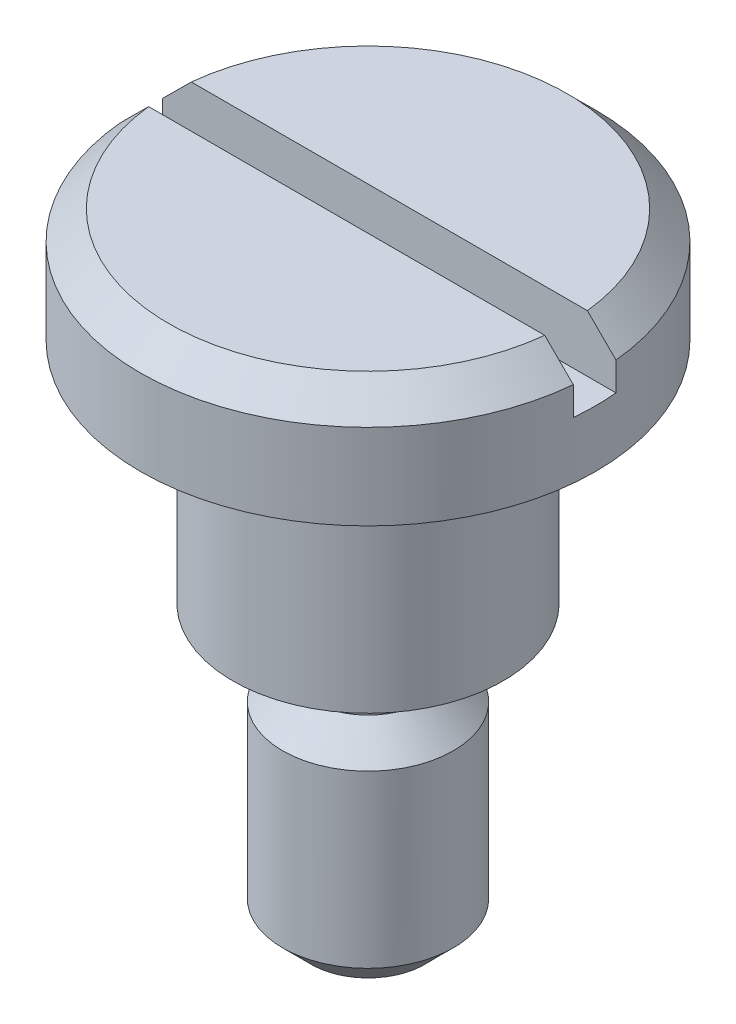
ISO-10303-21;
HEADER;
FILE_DESCRIPTION(('STEP AP214'),'2;1');
FILE_NAME('part.step','',(''),(''),'','','');
FILE_SCHEMA(('AUTOMOTIVE_DESIGN { 1 0 10303 214 1 1 1 1 }'));
ENDSEC;
DATA;
#1=APPLICATION_CONTEXT('core data for automotive mechanical design processes');
#2=APPLICATION_PROTOCOL_DEFINITION('international standard','automotive_design',2000,#1);
#3=PRODUCT_CONTEXT('',#1,'mechanical');
#4=PRODUCT('Part','Part','',(#3));
#5=PRODUCT_RELATED_PRODUCT_CATEGORY('part','',(#4));
#6=PRODUCT_DEFINITION_FORMATION('','',#4);
#7=PRODUCT_DEFINITION_CONTEXT('part definition',#1,'design');
#8=PRODUCT_DEFINITION('design','',#6,#7);
#9=PRODUCT_DEFINITION_SHAPE('','',#8);
#10=(LENGTH_UNIT() NAMED_UNIT(*) SI_UNIT(.MILLI.,.METRE.));
#11=(NAMED_UNIT(*) PLANE_ANGLE_UNIT() SI_UNIT($,.RADIAN.));
#12=(NAMED_UNIT(*) SI_UNIT($,.STERADIAN.) SOLID_ANGLE_UNIT());
#13=UNCERTAINTY_MEASURE_WITH_UNIT(LENGTH_MEASURE(1.E-05),#10,'distance_accuracy_value','');
#14=(GEOMETRIC_REPRESENTATION_CONTEXT(3) GLOBAL_UNCERTAINTY_ASSIGNED_CONTEXT((#13)) GLOBAL_UNIT_ASSIGNED_CONTEXT((#10,
#11,#12)) REPRESENTATION_CONTEXT('',''));
#15=CARTESIAN_POINT('',(0.,0.,0.));
#16=DIRECTION('',(0.,0.,1.));
#17=DIRECTION('',(1.,0.,0.));
#18=AXIS2_PLACEMENT_3D('',#15,#16,#17);
#19=CARTESIAN_POINT('',(8.,22.,0.));
#20=DIRECTION('',(0.,-1.,0.));
#21=DIRECTION('',(1.,0.,0.));
#22=AXIS2_PLACEMENT_3D('',#19,#20,#21);
#23=PLANE('',#22);
#24=CARTESIAN_POINT('',(0.,22.,0.));
#25=DIRECTION('',(0.,-1.,0.));
#26=DIRECTION('',(1.,0.,0.));
#27=AXIS2_PLACEMENT_3D('',#24,#25,#26);
#28=CIRCLE('',#27,6.99999999999999);
#29=CARTESIAN_POINT('',(6.95970545353752,22.,-0.75));
#30=VERTEX_POINT('',#29);
#31=CARTESIAN_POINT('',(-6.95970545353752,22.,-0.75));
#32=VERTEX_POINT('',#31);
#33=EDGE_CURVE('E148',#30,#32,#28,.F.);
#34=ORIENTED_EDGE('',*,*,#33,.T.);
#35=DIRECTION('',(-1.,0.,0.));
#36=VECTOR('',#35,1.);
#37=CARTESIAN_POINT('',(-7.964766161037,22.,-0.75));
#38=LINE('',#37,#36);
#39=EDGE_CURVE('E108',#30,#32,#38,.T.);
#40=ORIENTED_EDGE('',*,*,#39,.F.);
#41=EDGE_LOOP('',(#34,#40));
#42=FACE_BOUND('',#41,.T.);
#43=ADVANCED_FACE('F34',(#42),#23,.F.);
#44=CARTESIAN_POINT('',(0.,22.,0.));
#45=DIRECTION('',(0.,-1.,0.));
#46=DIRECTION('',(1.,0.,0.));
#47=AXIS2_PLACEMENT_3D('',#44,#45,#46);
#48=CONICAL_SURFACE('',#47,6.99999999999999,0.785398163397448);
#49=CARTESIAN_POINT('',(17.5414999807444,11.442473933539,-0.75));
#50=CARTESIAN_POINT('',(16.934728151679,12.0486874615124,-0.75));
#51=CARTESIAN_POINT('',(16.3279318310208,12.6548764823828,-0.75));
#52=CARTESIAN_POINT('',(15.1142562360307,13.8671758328752,-0.75));
#53=CARTESIAN_POINT('',(14.5073769614089,14.4732861622067,-0.75));
#54=CARTESIAN_POINT('',(13.2934560776545,15.6854437937346,-0.75));
#55=CARTESIAN_POINT('',(12.6864144592914,16.2914910866876,-0.75));
#56=CARTESIAN_POINT('',(11.4721610260657,17.5034109072837,-0.75));
#57=CARTESIAN_POINT('',(10.8649492118056,18.1092834355306,-0.75));
#58=CARTESIAN_POINT('',(9.65119667440743,19.3198088995363,-0.75));
#59=CARTESIAN_POINT('',(9.04465637967325,19.9244622647251,-0.75));
#60=CARTESIAN_POINT('',(8.13446986233434,20.831071345008,-0.75));
#61=CARTESIAN_POINT('',(7.8310100371904,21.1332141748789,-0.75));
#62=CARTESIAN_POINT('',(7.22391300253388,21.7373209392757,-0.75));
#63=CARTESIAN_POINT('',(6.92027579321095,22.0392848739921,-0.75));
#64=CARTESIAN_POINT('',(6.3127585031793,22.6429376578914,-0.75));
#65=CARTESIAN_POINT('',(6.00887843554386,22.9446265202264,-0.75));
#66=CARTESIAN_POINT('',(5.40071561745348,23.5476006086176,-0.75));
#67=CARTESIAN_POINT('',(5.0964328653555,23.8488858330169,-0.75));
#68=CARTESIAN_POINT('',(4.48721680699414,24.4507873145134,-0.75));
#69=CARTESIAN_POINT('',(4.18228351313857,24.7514035841502,-0.75));
#70=CARTESIAN_POINT('',(3.72395411736517,25.2013795844683,-0.75));
#71=CARTESIAN_POINT('',(3.57102325198564,25.3512130215695,-0.75));
#72=CARTESIAN_POINT('',(3.26470738597545,25.6504147852155,-0.75));
#73=CARTESIAN_POINT('',(3.11132238644352,25.7997831128838,-0.75));
#74=CARTESIAN_POINT('',(2.87344112197551,26.0303633901401,-0.75));
#75=CARTESIAN_POINT('',(2.78918674736265,26.1118248082896,-0.75));
#76=CARTESIAN_POINT('',(2.62040758518398,26.2744677855789,-0.75));
#77=CARTESIAN_POINT('',(2.5358827965887,26.3556493436509,-0.75));
#78=CARTESIAN_POINT('',(2.36644400534044,26.5176745333187,-0.75));
#79=CARTESIAN_POINT('',(2.28152985917242,26.5985180150561,-0.75));
#80=CARTESIAN_POINT('',(2.11121670939018,26.7596911220156,-0.75));
#81=CARTESIAN_POINT('',(2.02581770947636,26.8400207511495,-0.75));
#82=CARTESIAN_POINT('',(1.82527076370351,27.0270923741968,-0.75));
#83=CARTESIAN_POINT('',(1.70985722780418,27.133551452882,-0.75));
#84=CARTESIAN_POINT('',(1.53525461072992,27.2915201207219,-0.75));
#85=CARTESIAN_POINT('',(1.47682848435559,27.3438707141749,-0.75));
#86=CARTESIAN_POINT('',(1.35928034463947,27.4477787299597,-0.75));
#87=CARTESIAN_POINT('',(1.30015835814014,27.4993361827106,-0.75));
#88=CARTESIAN_POINT('',(1.15799131163723,27.621022220434,-0.75));
#89=CARTESIAN_POINT('',(1.07450917769939,27.690648854116,-0.75));
#90=CARTESIAN_POINT('',(0.946894886136243,27.7923316941437,-0.75));
#91=CARTESIAN_POINT('',(0.90389897747285,27.8258095104373,-0.75));
#92=CARTESIAN_POINT('',(0.816885694502634,27.8914071251364,-0.75));
#93=CARTESIAN_POINT('',(0.772868497697674,27.9235271568293,-0.75));
#94=CARTESIAN_POINT('',(0.69298265722103,27.9791718137957,-0.75));
#95=CARTESIAN_POINT('',(0.657375651358466,28.0030698805079,-0.75));
#96=CARTESIAN_POINT('',(0.585063694272161,28.0491992537746,-0.75));
#97=CARTESIAN_POINT('',(0.54835823871039,28.0714297777506,-0.75));
#98=CARTESIAN_POINT('',(0.473720096188376,28.1134547675553,-0.75));
#99=CARTESIAN_POINT('',(0.435791979005953,28.133257217005,-0.75));
#100=CARTESIAN_POINT('',(0.358375955998075,28.1694794840139,-0.75));
#101=CARTESIAN_POINT('',(0.318889927131753,28.1859032323201,-0.75));
#102=CARTESIAN_POINT('',(0.233864997275503,28.2154964657084,-0.75));
#103=CARTESIAN_POINT('',(0.188130389790628,28.2281300615747,-0.75));
#104=CARTESIAN_POINT('',(0.0952562653113347,28.2453353611092,-0.75));
#105=CARTESIAN_POINT('',(0.0481228412745358,28.2499379436972,-0.75));
#106=CARTESIAN_POINT('',(-0.0463420306781687,28.2500610091859,-0.75));
#107=CARTESIAN_POINT('',(-0.0936735338268064,28.245545993239,-0.75));
#108=CARTESIAN_POINT('',(-0.1869160048223,28.2284362039912,-0.75));
#109=CARTESIAN_POINT('',(-0.232821637633046,28.2158142055641,-0.75));
#110=CARTESIAN_POINT('',(-0.326356777383556,28.183352972457,-0.75));
#111=CARTESIAN_POINT('',(-0.373795005324541,28.1629863962203,-0.75));
#112=CARTESIAN_POINT('',(-0.466480009797677,28.1176933624451,-0.75));
#113=CARTESIAN_POINT('',(-0.511722235371966,28.0927579074271,-0.75));
#114=CARTESIAN_POINT('',(-0.600770314434956,28.0397197682557,-0.75));
#115=CARTESIAN_POINT('',(-0.644561752123602,28.01159330458,-0.75));
#116=CARTESIAN_POINT('',(-0.730728584600748,27.9533579234847,-0.75));
#117=CARTESIAN_POINT('',(-0.773105280842991,27.923250908266,-0.75));
#118=CARTESIAN_POINT('',(-0.86096669260368,27.8586004765428,-0.75));
#119=CARTESIAN_POINT('',(-0.906344484700812,27.8239127286333,-0.75));
#120=CARTESIAN_POINT('',(-0.996179963196404,27.7533616832507,-0.75));
#121=CARTESIAN_POINT('',(-1.04063753157695,27.7174982365005,-0.75));
#122=CARTESIAN_POINT('',(-1.17301852220231,27.6086255494271,-0.75));
#123=CARTESIAN_POINT('',(-1.25990957775717,27.5343648950202,-0.75));
#124=CARTESIAN_POINT('',(-1.4321891766369,27.3838505880067,-0.75));
#125=CARTESIAN_POINT('',(-1.51757490297322,27.307593750691,-0.75));
#126=CARTESIAN_POINT('',(-1.68725017110537,27.1539173411141,-0.75));
#127=CARTESIAN_POINT('',(-1.77154000102012,27.0764980864864,-0.75));
#128=CARTESIAN_POINT('',(-1.93908533695118,26.9211600557452,-0.75));
#129=CARTESIAN_POINT('',(-2.02234349311558,26.8432441287644,-0.75));
#130=CARTESIAN_POINT('',(-2.18835145736876,26.686861916576,-0.75));
#131=CARTESIAN_POINT('',(-2.27110123054646,26.6083955943474,-0.75));
#132=CARTESIAN_POINT('',(-2.4361405686901,26.4511463950929,-0.75));
#133=CARTESIAN_POINT('',(-2.51843051238192,26.3723639151284,-0.75));
#134=CARTESIAN_POINT('',(-2.68272315787683,26.214503950753,-0.75));
#135=CARTESIAN_POINT('',(-2.76472586619165,26.1354264731149,-0.75));
#136=CARTESIAN_POINT('',(-3.0097772209482,25.8984658074307,-0.75));
#137=CARTESIAN_POINT('',(-3.17250263509659,25.7402484571436,-0.75));
#138=CARTESIAN_POINT('',(-3.49740744762277,25.4232538641055,-0.75));
#139=CARTESIAN_POINT('',(-3.65958684409572,25.2644766194052,-0.75));
#140=CARTESIAN_POINT('',(-4.14558747494633,24.7875862935706,-0.75));
#141=CARTESIAN_POINT('',(-4.4688656337781,24.468919985165,-0.75));
#142=CARTESIAN_POINT('',(-5.11481744847824,23.8307201509279,-0.75));
#143=CARTESIAN_POINT('',(-5.43749081303524,23.5111863307703,-0.75));
#144=CARTESIAN_POINT('',(-6.08239683995079,22.8716792748441,-0.75));
#145=CARTESIAN_POINT('',(-6.40462950571259,22.5517060425075,-0.75));
#146=CARTESIAN_POINT('',(-7.04895014607161,21.9113517083915,-0.75));
#147=CARTESIAN_POINT('',(-7.37103800826907,21.5909704935644,-0.75));
#148=CARTESIAN_POINT('',(-8.01502708700054,20.9500192174201,-0.75));
#149=CARTESIAN_POINT('',(-8.33692830314787,20.6294491557145,-0.75));
#150=CARTESIAN_POINT('',(-9.30236300677184,19.667619271465,-0.75));
#151=CARTESIAN_POINT('',(-9.94570272604828,19.0261649744975,-0.75));
#152=CARTESIAN_POINT('',(-11.1687078817978,17.8062110617129,-0.75));
#153=CARTESIAN_POINT('',(-11.7483995935195,17.227737779525,-0.75));
#154=CARTESIAN_POINT('',(-12.907656209652,16.0706208222213,-0.75));
#155=CARTESIAN_POINT('',(-13.4872211085098,15.4919771415426,-0.75));
#156=CARTESIAN_POINT('',(-14.6459557776393,14.3348859776017,-0.75));
#157=CARTESIAN_POINT('',(-15.2251255985507,13.7564385450473,-0.75));
#158=CARTESIAN_POINT('',(-16.3833711958861,12.5994929807352,-0.75));
#159=CARTESIAN_POINT('',(-16.9624469750232,12.0209948516936,-0.75));
#160=CARTESIAN_POINT('',(-17.5414999807444,11.442473933539,-0.75));
#161=B_SPLINE_CURVE_WITH_KNOTS('',3,(#49,#50,#51,#52,#53,#54,#55,#56,#57,#58,#59,#60,#61,#62,
#63,#64,#65,#66,#67,#68,#69,#70,#71,#72,#73,#74,#75,#76,#77,#78,#79,#80,#81,#82,#83,#84,#85,#86,
#87,#88,#89,#90,#91,#92,#93,#94,#95,#96,#97,#98,#99,#100,#101,#102,#103,#104,#105,#106,#107,
#108,#109,#110,#111,#112,#113,#114,#115,#116,#117,#118,#119,#120,#121,#122,#123,#124,#125,#126,
#127,#128,#129,#130,#131,#132,#133,#134,#135,#136,#137,#138,#139,#140,#141,#142,#143,#144,#145,
#146,#147,#148,#149,#150,#151,#152,#153,#154,#155,#156,#157,#158,#159,#160),.UNSPECIFIED.,.F.,
.F.,(4,2,2,2,2,2,2,2,2,2,2,2,2,2,2,2,2,2,2,2,2,2,2,2,2,2,2,2,2,2,2,2,2,2,2,2,2,2,2,2,2,2,2,2,2,
2,2,2,2,2,2,2,2,2,2,4),(0.,2.57313079333366,5.14627082615955,7.71962185103834,10.2929638775751,
12.8622965532835,14.1469767696476,15.4316556150889,16.7162694249575,18.0008884925675,
19.2854832738205,19.9277764015614,20.5700679766135,20.9216536893458,21.273240742164,
21.624969911041,21.9766963991221,22.4477226520162,22.6830624330437,22.9183931655176,
23.2444345257296,23.4078943970678,23.5713260684801,23.6999427338592,23.8286193862769,
23.956860902481,24.0849523693729,24.2267429529487,24.3679871461479,24.5097823257481,
24.6520561939771,24.8065659402137,24.9613832977727,25.1174412949234,25.273351536328,
25.4446757166792,25.6160217347511,25.9588668977179,26.3022971092458,26.6456351264355,
26.9877217466526,27.329831601391,27.6715978731879,28.0133563461948,28.6942433756892,
29.3751327780865,30.7369346679042,32.0992777814274,33.4616103142848,34.8244977613734,
36.1873880219313,38.9128504459925,41.3696907461412,43.8266229233733,46.2823004252134,
48.7378858030531),.UNSPECIFIED.);
#162=CARTESIAN_POINT('',(7.964766161037,21.,-0.75));
#163=VERTEX_POINT('',#162);
#164=EDGE_CURVE('E11',#163,#30,#161,.T.);
#165=ORIENTED_EDGE('',*,*,#164,.F.);
#166=CARTESIAN_POINT('',(0.,21.,0.));
#167=DIRECTION('',(0.,-1.,0.));
#168=DIRECTION('',(1.,0.,0.));
#169=AXIS2_PLACEMENT_3D('',#166,#167,#168);
#170=CIRCLE('',#169,8.);
#171=CARTESIAN_POINT('',(-7.964766161037,21.,-0.75));
#172=VERTEX_POINT('',#171);
#173=EDGE_CURVE('E151',#172,#163,#170,.T.);
#174=ORIENTED_EDGE('',*,*,#173,.F.);
#175=EDGE_CURVE('E39',#32,#172,#161,.T.);
#176=ORIENTED_EDGE('',*,*,#175,.F.);
#177=ORIENTED_EDGE('',*,*,#33,.F.);
#178=EDGE_LOOP('',(#165,#174,#176,#177));
#179=FACE_BOUND('',#178,.T.);
#180=ADVANCED_FACE('F195',(#179),#48,.T.);
#181=CARTESIAN_POINT('',(0.,0.,0.));
#182=DIRECTION('',(0.,1.,0.));
#183=DIRECTION('',(-1.,0.,0.));
#184=AXIS2_PLACEMENT_3D('',#181,#182,#183);
#185=PLANE('',#184);
#186=CARTESIAN_POINT('',(0.,0.,0.));
#187=DIRECTION('',(0.,1.,0.));
#188=DIRECTION('',(-1.,0.,0.));
#189=AXIS2_PLACEMENT_3D('',#186,#187,#188);
#190=CIRCLE('',#189,1.99999999999999);
#191=CARTESIAN_POINT('',(-1.99999999999999,0.,0.));
#192=VERTEX_POINT('',#191);
#193=EDGE_CURVE('E144',#192,#192,#190,.F.);
#194=ORIENTED_EDGE('',*,*,#193,.T.);
#195=EDGE_LOOP('',(#194));
#196=FACE_BOUND('',#195,.T.);
#197=ADVANCED_FACE('F191',(#196),#185,.F.);
#198=CARTESIAN_POINT('',(0.,22.,0.));
#199=DIRECTION('',(0.,1.,0.));
#200=DIRECTION('',(-1.,0.,0.));
#201=AXIS2_PLACEMENT_3D('',#198,#199,#200);
#202=CYLINDRICAL_SURFACE('',#201,3.);
#203=CARTESIAN_POINT('',(0.,6.99999999999999,0.));
#204=DIRECTION('',(0.,-1.,0.));
#205=DIRECTION('',(1.,0.,0.));
#206=AXIS2_PLACEMENT_3D('',#203,#204,#205);
#207=CIRCLE('',#206,3.);
#208=CARTESIAN_POINT('',(3.,6.99999999999999,0.));
#209=VERTEX_POINT('',#208);
#210=EDGE_CURVE('E141',#209,#209,#207,.T.);
#211=ORIENTED_EDGE('',*,*,#210,.T.);
#212=EDGE_LOOP('',(#211));
#213=FACE_BOUND('',#212,.T.);
#214=CARTESIAN_POINT('',(0.,1.,0.));
#215=DIRECTION('',(0.,1.,0.));
#216=DIRECTION('',(-1.,0.,0.));
#217=AXIS2_PLACEMENT_3D('',#214,#215,#216);
#218=CIRCLE('',#217,3.);
#219=CARTESIAN_POINT('',(-3.,1.,0.));
#220=VERTEX_POINT('',#219);
#221=EDGE_CURVE('E138',#220,#220,#218,.T.);
#222=ORIENTED_EDGE('',*,*,#221,.T.);
#223=EDGE_LOOP('',(#222));
#224=FACE_BOUND('',#223,.T.);
#225=ADVANCED_FACE('F187',(#213,#224),#202,.T.);
#226=CARTESIAN_POINT('',(0.,22.,0.));
#227=DIRECTION('',(0.,1.,0.));
#228=DIRECTION('',(-1.,0.,0.));
#229=AXIS2_PLACEMENT_3D('',#226,#227,#228);
#230=CYLINDRICAL_SURFACE('',#229,2.);
#231=CARTESIAN_POINT('',(0.,10.,0.));
#232=DIRECTION('',(0.,1.,0.));
#233=DIRECTION('',(-1.,0.,0.));
#234=AXIS2_PLACEMENT_3D('',#231,#232,#233);
#235=CIRCLE('',#234,2.);
#236=CARTESIAN_POINT('',(-2.,10.,0.));
#237=VERTEX_POINT('',#236);
#238=EDGE_CURVE('E132',#237,#237,#235,.T.);
#239=ORIENTED_EDGE('',*,*,#238,.F.);
#240=EDGE_LOOP('',(#239));
#241=FACE_BOUND('',#240,.T.);
#242=CARTESIAN_POINT('',(0.,8.,0.));
#243=DIRECTION('',(0.,1.,0.));
#244=DIRECTION('',(-1.,0.,0.));
#245=AXIS2_PLACEMENT_3D('',#242,#243,#244);
#246=CIRCLE('',#245,2.);
#247=CARTESIAN_POINT('',(-2.,8.,0.));
#248=VERTEX_POINT('',#247);
#249=EDGE_CURVE('E135',#248,#248,#246,.T.);
#250=ORIENTED_EDGE('',*,*,#249,.T.);
#251=EDGE_LOOP('',(#250));
#252=FACE_BOUND('',#251,.T.);
#253=ADVANCED_FACE('F183',(#241,#252),#230,.T.);
#254=CARTESIAN_POINT('',(2.,10.,0.));
#255=DIRECTION('',(0.,1.,0.));
#256=DIRECTION('',(-1.,0.,0.));
#257=AXIS2_PLACEMENT_3D('',#254,#255,#256);
#258=PLANE('',#257);
#259=CARTESIAN_POINT('',(0.,10.,0.));
#260=DIRECTION('',(0.,1.,0.));
#261=DIRECTION('',(-1.,0.,0.));
#262=AXIS2_PLACEMENT_3D('',#259,#260,#261);
#263=CIRCLE('',#262,4.75);
#264=CARTESIAN_POINT('',(-4.75,10.,0.));
#265=VERTEX_POINT('',#264);
#266=EDGE_CURVE('E129',#265,#265,#263,.T.);
#267=ORIENTED_EDGE('',*,*,#266,.F.);
#268=EDGE_LOOP('',(#267));
#269=FACE_BOUND('',#268,.T.);
#270=ORIENTED_EDGE('',*,*,#238,.T.);
#271=EDGE_LOOP('',(#270));
#272=FACE_BOUND('',#271,.T.);
#273=ADVANCED_FACE('F179',(#269,#272),#258,.F.);
#274=CARTESIAN_POINT('',(0.,22.,0.));
#275=DIRECTION('',(0.,1.,0.));
#276=DIRECTION('',(-1.,0.,0.));
#277=AXIS2_PLACEMENT_3D('',#274,#275,#276);
#278=CYLINDRICAL_SURFACE('',#277,4.75);
#279=CARTESIAN_POINT('',(0.,18.,0.));
#280=DIRECTION('',(0.,1.,0.));
#281=DIRECTION('',(-1.,0.,0.));
#282=AXIS2_PLACEMENT_3D('',#279,#280,#281);
#283=CIRCLE('',#282,4.75);
#284=CARTESIAN_POINT('',(-4.75,18.,0.));
#285=VERTEX_POINT('',#284);
#286=EDGE_CURVE('E125',#285,#285,#283,.T.);
#287=ORIENTED_EDGE('',*,*,#286,.F.);
#288=EDGE_LOOP('',(#287));
#289=FACE_BOUND('',#288,.T.);
#290=ORIENTED_EDGE('',*,*,#266,.T.);
#291=EDGE_LOOP('',(#290));
#292=FACE_BOUND('',#291,.T.);
#293=ADVANCED_FACE('F175',(#289,#292),#278,.T.);
#294=CARTESIAN_POINT('',(4.75,18.,0.));
#295=DIRECTION('',(0.,1.,0.));
#296=DIRECTION('',(-1.,0.,0.));
#297=AXIS2_PLACEMENT_3D('',#294,#295,#296);
#298=PLANE('',#297);
#299=CARTESIAN_POINT('',(0.,18.,0.));
#300=DIRECTION('',(0.,1.,0.));
#301=DIRECTION('',(-1.,0.,0.));
#302=AXIS2_PLACEMENT_3D('',#299,#300,#301);
#303=CIRCLE('',#302,8.);
#304=CARTESIAN_POINT('',(-8.,18.,0.));
#305=VERTEX_POINT('',#304);
#306=EDGE_CURVE('E122',#305,#305,#303,.T.);
#307=ORIENTED_EDGE('',*,*,#306,.F.);
#308=EDGE_LOOP('',(#307));
#309=FACE_BOUND('',#308,.T.);
#310=ORIENTED_EDGE('',*,*,#286,.T.);
#311=EDGE_LOOP('',(#310));
#312=FACE_BOUND('',#311,.T.);
#313=ADVANCED_FACE('F172',(#309,#312),#298,.F.);
#314=CARTESIAN_POINT('',(0.,22.,0.));
#315=DIRECTION('',(0.,1.,0.));
#316=DIRECTION('',(-1.,0.,0.));
#317=AXIS2_PLACEMENT_3D('',#314,#315,#316);
#318=CYLINDRICAL_SURFACE('',#317,8.);
#319=ORIENTED_EDGE('',*,*,#173,.T.);
#320=DIRECTION('',(0.,1.,0.));
#321=VECTOR('',#320,1.);
#322=CARTESIAN_POINT('',(7.964766161037,20.,-0.75));
#323=LINE('',#322,#321);
#324=CARTESIAN_POINT('',(7.964766161037,20.,-0.75));
#325=VERTEX_POINT('',#324);
#326=EDGE_CURVE('E117',#325,#163,#323,.T.);
#327=ORIENTED_EDGE('',*,*,#326,.F.);
#328=CARTESIAN_POINT('',(0.,20.,0.));
#329=DIRECTION('',(0.,1.,0.));
#330=DIRECTION('',(0.,0.,1.));
#331=AXIS2_PLACEMENT_3D('',#328,#329,#330);
#332=CIRCLE('',#331,8.);
#333=CARTESIAN_POINT('',(7.964766161037,20.,0.75));
#334=VERTEX_POINT('',#333);
#335=EDGE_CURVE('E99',#334,#325,#332,.T.);
#336=ORIENTED_EDGE('',*,*,#335,.F.);
#337=DIRECTION('',(0.,1.,0.));
#338=VECTOR('',#337,1.);
#339=CARTESIAN_POINT('',(7.964766161037,20.,0.75));
#340=LINE('',#339,#338);
#341=CARTESIAN_POINT('',(7.964766161037,21.,0.75));
#342=VERTEX_POINT('',#341);
#343=EDGE_CURVE('E96',#334,#342,#340,.T.);
#344=ORIENTED_EDGE('',*,*,#343,.T.);
#345=CARTESIAN_POINT('',(-7.964766161037,21.,0.75));
#346=VERTEX_POINT('',#345);
#347=EDGE_CURVE('E115',#342,#346,#170,.T.);
#348=ORIENTED_EDGE('',*,*,#347,.T.);
#349=DIRECTION('',(0.,1.,0.));
#350=VECTOR('',#349,1.);
#351=CARTESIAN_POINT('',(-7.964766161037,20.,0.75));
#352=LINE('',#351,#350);
#353=CARTESIAN_POINT('',(-7.964766161037,20.,0.75));
#354=VERTEX_POINT('',#353);
#355=EDGE_CURVE('E93',#354,#346,#352,.T.);
#356=ORIENTED_EDGE('',*,*,#355,.F.);
#357=CARTESIAN_POINT('',(0.,20.,0.));
#358=DIRECTION('',(0.,1.,0.));
#359=DIRECTION('',(0.,0.,1.));
#360=AXIS2_PLACEMENT_3D('',#357,#358,#359);
#361=CIRCLE('',#360,8.);
#362=CARTESIAN_POINT('',(-7.964766161037,20.,-0.75));
#363=VERTEX_POINT('',#362);
#364=EDGE_CURVE('E100',#363,#354,#361,.T.);
#365=ORIENTED_EDGE('',*,*,#364,.F.);
#366=DIRECTION('',(0.,1.,0.));
#367=VECTOR('',#366,1.);
#368=CARTESIAN_POINT('',(-7.964766161037,20.,-0.75));
#369=LINE('',#368,#367);
#370=EDGE_CURVE('E126',#363,#172,#369,.T.);
#371=ORIENTED_EDGE('',*,*,#370,.T.);
#372=EDGE_LOOP('',(#319,#327,#336,#344,#348,#356,#365,#371));
#373=FACE_BOUND('',#372,.T.);
#374=ORIENTED_EDGE('',*,*,#306,.T.);
#375=EDGE_LOOP('',(#374));
#376=FACE_BOUND('',#375,.T.);
#377=ADVANCED_FACE('F112',(#373,#376),#318,.T.);
#378=CARTESIAN_POINT('',(-6.95970545353752,22.,0.75));
#379=VERTEX_POINT('',#378);
#380=CARTESIAN_POINT('',(6.95970545353752,22.,0.75));
#381=VERTEX_POINT('',#380);
#382=EDGE_CURVE('E147',#379,#381,#28,.F.);
#383=ORIENTED_EDGE('',*,*,#382,.T.);
#384=DIRECTION('',(1.,0.,0.));
#385=VECTOR('',#384,1.);
#386=CARTESIAN_POINT('',(-7.964766161037,22.,0.75));
#387=LINE('',#386,#385);
#388=EDGE_CURVE('E55',#379,#381,#387,.T.);
#389=ORIENTED_EDGE('',*,*,#388,.F.);
#390=EDGE_LOOP('',(#383,#389));
#391=FACE_BOUND('',#390,.T.);
#392=ADVANCED_FACE('F165',(#391),#23,.F.);
#393=CARTESIAN_POINT('',(0.,8.,0.));
#394=DIRECTION('',(0.,-1.,0.));
#395=DIRECTION('',(1.,0.,0.));
#396=AXIS2_PLACEMENT_3D('',#393,#394,#395);
#397=CONICAL_SURFACE('',#396,1.99999999999999,0.785398163397446);
#398=ORIENTED_EDGE('',*,*,#210,.F.);
#399=EDGE_LOOP('',(#398));
#400=FACE_BOUND('',#399,.T.);
#401=ORIENTED_EDGE('',*,*,#249,.F.);
#402=EDGE_LOOP('',(#401));
#403=FACE_BOUND('',#402,.T.);
#404=ADVANCED_FACE('F168',(#400,#403),#397,.T.);
#405=CARTESIAN_POINT('',(0.,1.,0.));
#406=DIRECTION('',(0.,1.,0.));
#407=DIRECTION('',(-1.,0.,0.));
#408=AXIS2_PLACEMENT_3D('',#405,#406,#407);
#409=CONICAL_SURFACE('',#408,3.,0.78539816339745);
#410=ORIENTED_EDGE('',*,*,#193,.F.);
#411=EDGE_LOOP('',(#410));
#412=FACE_BOUND('',#411,.T.);
#413=ORIENTED_EDGE('',*,*,#221,.F.);
#414=EDGE_LOOP('',(#413));
#415=FACE_BOUND('',#414,.T.);
#416=ADVANCED_FACE('F198',(#412,#415),#409,.T.);
#417=CARTESIAN_POINT('',(-17.5414999807444,11.442473933539,0.75));
#418=CARTESIAN_POINT('',(-16.934728151679,12.0486874615124,0.75));
#419=CARTESIAN_POINT('',(-16.3279318310208,12.6548764823828,0.75));
#420=CARTESIAN_POINT('',(-15.1142562360308,13.8671758328752,0.75));
#421=CARTESIAN_POINT('',(-14.5073769614089,14.4732861622067,0.75));
#422=CARTESIAN_POINT('',(-13.2934560776545,15.6854437937346,0.75));
#423=CARTESIAN_POINT('',(-12.6864144592914,16.2914910866875,0.75));
#424=CARTESIAN_POINT('',(-11.4721610260657,17.5034109072837,0.75));
#425=CARTESIAN_POINT('',(-10.8649492118057,18.1092834355306,0.75));
#426=CARTESIAN_POINT('',(-9.65119667440746,19.3198088995362,0.75));
#427=CARTESIAN_POINT('',(-9.04465637967328,19.9244622647251,0.75));
#428=CARTESIAN_POINT('',(-8.13446986233436,20.831071345008,0.75));
#429=CARTESIAN_POINT('',(-7.83101003719042,21.1332141748789,0.75));
#430=CARTESIAN_POINT('',(-7.2239130025339,21.7373209392757,0.75));
#431=CARTESIAN_POINT('',(-6.92027579321096,22.0392848739921,0.75));
#432=CARTESIAN_POINT('',(-6.31275850317931,22.6429376578914,0.75));
#433=CARTESIAN_POINT('',(-6.00887843554388,22.9446265202264,0.75));
#434=CARTESIAN_POINT('',(-5.40071561745349,23.5476006086176,0.75));
#435=CARTESIAN_POINT('',(-5.09643286535551,23.8488858330169,0.75));
#436=CARTESIAN_POINT('',(-4.48721680699415,24.4507873145134,0.75));
#437=CARTESIAN_POINT('',(-4.18228351313858,24.7514035841502,0.75));
#438=CARTESIAN_POINT('',(-3.72395411736517,25.2013795844683,0.75));
#439=CARTESIAN_POINT('',(-3.57102325198564,25.3512130215695,0.75));
#440=CARTESIAN_POINT('',(-3.26470738597545,25.6504147852155,0.75));
#441=CARTESIAN_POINT('',(-3.11132238644352,25.7997831128838,0.75));
#442=CARTESIAN_POINT('',(-2.87344112197551,26.0303633901401,0.75));
#443=CARTESIAN_POINT('',(-2.78918674736265,26.1118248082896,0.75));
#444=CARTESIAN_POINT('',(-2.62040758518398,26.2744677855789,0.75));
#445=CARTESIAN_POINT('',(-2.5358827965887,26.3556493436509,0.75));
#446=CARTESIAN_POINT('',(-2.36644400534044,26.5176745333187,0.75));
#447=CARTESIAN_POINT('',(-2.28152985917242,26.5985180150561,0.75));
#448=CARTESIAN_POINT('',(-2.11121670939018,26.7596911220156,0.75));
#449=CARTESIAN_POINT('',(-2.02581770947636,26.8400207511495,0.75));
#450=CARTESIAN_POINT('',(-1.82527076370352,27.0270923741968,0.75));
#451=CARTESIAN_POINT('',(-1.70985722780418,27.133551452882,0.75));
#452=CARTESIAN_POINT('',(-1.53525461072993,27.2915201207219,0.75));
#453=CARTESIAN_POINT('',(-1.47682848435559,27.3438707141749,0.75));
#454=CARTESIAN_POINT('',(-1.35928034463947,27.4477787299597,0.75));
#455=CARTESIAN_POINT('',(-1.30015835814014,27.4993361827106,0.75));
#456=CARTESIAN_POINT('',(-1.15799131163723,27.621022220434,0.75));
#457=CARTESIAN_POINT('',(-1.07450917769939,27.690648854116,0.75));
#458=CARTESIAN_POINT('',(-0.946894886136245,27.7923316941437,0.75));
#459=CARTESIAN_POINT('',(-0.903898977472851,27.8258095104373,0.75));
#460=CARTESIAN_POINT('',(-0.816885694502636,27.8914071251364,0.75));
#461=CARTESIAN_POINT('',(-0.772868497697675,27.9235271568293,0.75));
#462=CARTESIAN_POINT('',(-0.692982657221032,27.9791718137957,0.75));
#463=CARTESIAN_POINT('',(-0.65737565135847,28.0030698805079,0.75));
#464=CARTESIAN_POINT('',(-0.585063694272165,28.0491992537746,0.75));
#465=CARTESIAN_POINT('',(-0.548358238710392,28.0714297777506,0.75));
#466=CARTESIAN_POINT('',(-0.473720096188376,28.1134547675553,0.75));
#467=CARTESIAN_POINT('',(-0.435791979005954,28.133257217005,0.75));
#468=CARTESIAN_POINT('',(-0.358375955998077,28.1694794840139,0.75));
#469=CARTESIAN_POINT('',(-0.318889927131753,28.1859032323201,0.75));
#470=CARTESIAN_POINT('',(-0.233864997275502,28.2154964657084,0.75));
#471=CARTESIAN_POINT('',(-0.188130389790627,28.2281300615747,0.75));
#472=CARTESIAN_POINT('',(-0.0952562653113337,28.2453353611092,0.75));
#473=CARTESIAN_POINT('',(-0.0481228412745346,28.2499379436972,0.75));
#474=CARTESIAN_POINT('',(0.0463420306781698,28.2500610091859,0.75));
#475=CARTESIAN_POINT('',(0.0936735338268071,28.245545993239,0.75));
#476=CARTESIAN_POINT('',(0.186916004822301,28.2284362039912,0.75));
#477=CARTESIAN_POINT('',(0.232821637633047,28.2158142055641,0.75));
#478=CARTESIAN_POINT('',(0.326356777383559,28.183352972457,0.75));
#479=CARTESIAN_POINT('',(0.373795005324545,28.1629863962203,0.75));
#480=CARTESIAN_POINT('',(0.466480009797684,28.117693362445,0.75));
#481=CARTESIAN_POINT('',(0.511722235371973,28.0927579074271,0.75));
#482=CARTESIAN_POINT('',(0.600770314434965,28.0397197682557,0.75));
#483=CARTESIAN_POINT('',(0.644561752123612,28.01159330458,0.75));
#484=CARTESIAN_POINT('',(0.730728584600757,27.9533579234847,0.75));
#485=CARTESIAN_POINT('',(0.773105280842999,27.923250908266,0.75));
#486=CARTESIAN_POINT('',(0.860966692603687,27.8586004765428,0.75));
#487=CARTESIAN_POINT('',(0.90634448470082,27.8239127286333,0.75));
#488=CARTESIAN_POINT('',(0.996179963196414,27.7533616832507,0.75));
#489=CARTESIAN_POINT('',(1.04063753157696,27.7174982365005,0.75));
#490=CARTESIAN_POINT('',(1.17301852220233,27.6086255494271,0.75));
#491=CARTESIAN_POINT('',(1.25990957775719,27.5343648950202,0.75));
#492=CARTESIAN_POINT('',(1.43218917663692,27.3838505880066,0.75));
#493=CARTESIAN_POINT('',(1.51757490297324,27.3075937506909,0.75));
#494=CARTESIAN_POINT('',(1.68725017110539,27.1539173411141,0.75));
#495=CARTESIAN_POINT('',(1.77154000102014,27.0764980864864,0.75));
#496=CARTESIAN_POINT('',(1.9390853369512,26.9211600557452,0.75));
#497=CARTESIAN_POINT('',(2.0223434931156,26.8432441287644,0.75));
#498=CARTESIAN_POINT('',(2.18835145736879,26.6868619165759,0.75));
#499=CARTESIAN_POINT('',(2.27110123054649,26.6083955943473,0.75));
#500=CARTESIAN_POINT('',(2.43614056869013,26.4511463950928,0.75));
#501=CARTESIAN_POINT('',(2.51843051238195,26.3723639151283,0.75));
#502=CARTESIAN_POINT('',(2.68272315787686,26.214503950753,0.75));
#503=CARTESIAN_POINT('',(2.76472586619169,26.1354264731149,0.75));
#504=CARTESIAN_POINT('',(3.00977722094824,25.8984658074307,0.75));
#505=CARTESIAN_POINT('',(3.17250263509663,25.7402484571436,0.75));
#506=CARTESIAN_POINT('',(3.49740744762281,25.4232538641054,0.75));
#507=CARTESIAN_POINT('',(3.65958684409576,25.2644766194051,0.75));
#508=CARTESIAN_POINT('',(4.14558747494638,24.7875862935705,0.75));
#509=CARTESIAN_POINT('',(4.46886563377816,24.468919985165,0.75));
#510=CARTESIAN_POINT('',(5.1148174484783,23.8307201509278,0.75));
#511=CARTESIAN_POINT('',(5.43749081303531,23.5111863307703,0.75));
#512=CARTESIAN_POINT('',(6.08239683995087,22.8716792748441,0.75));
#513=CARTESIAN_POINT('',(6.40462950571267,22.5517060425074,0.75));
#514=CARTESIAN_POINT('',(7.04895014607171,21.9113517083914,0.75));
#515=CARTESIAN_POINT('',(7.37103800826917,21.5909704935643,0.75));
#516=CARTESIAN_POINT('',(8.01502708700065,20.95001921742,0.75));
#517=CARTESIAN_POINT('',(8.33692830314799,20.6294491557143,0.75));
#518=CARTESIAN_POINT('',(9.30236300677196,19.6676192714649,0.75));
#519=CARTESIAN_POINT('',(9.94570272604841,19.0261649744974,0.75));
#520=CARTESIAN_POINT('',(11.1687078817979,17.8062110617128,0.75));
#521=CARTESIAN_POINT('',(11.7483995935197,17.2277377795249,0.75));
#522=CARTESIAN_POINT('',(12.9076562096521,16.0706208222212,0.75));
#523=CARTESIAN_POINT('',(13.4872211085099,15.4919771415425,0.75));
#524=CARTESIAN_POINT('',(14.6459557776394,14.3348859776016,0.75));
#525=CARTESIAN_POINT('',(15.2251255985507,13.7564385450473,0.75));
#526=CARTESIAN_POINT('',(16.3833711958862,12.5994929807352,0.75));
#527=CARTESIAN_POINT('',(16.9624469750233,12.0209948516935,0.75));
#528=CARTESIAN_POINT('',(17.5414999807444,11.442473933539,0.75));
#529=B_SPLINE_CURVE_WITH_KNOTS('',3,(#417,#418,#419,#420,#421,#422,#423,#424,#425,#426,#427,
#428,#429,#430,#431,#432,#433,#434,#435,#436,#437,#438,#439,#440,#441,#442,#443,#444,#445,#446,
#447,#448,#449,#450,#451,#452,#453,#454,#455,#456,#457,#458,#459,#460,#461,#462,#463,#464,#465,
#466,#467,#468,#469,#470,#471,#472,#473,#474,#475,#476,#477,#478,#479,#480,#481,#482,#483,#484,
#485,#486,#487,#488,#489,#490,#491,#492,#493,#494,#495,#496,#497,#498,#499,#500,#501,#502,#503,
#504,#505,#506,#507,#508,#509,#510,#511,#512,#513,#514,#515,#516,#517,#518,#519,#520,#521,#522,
#523,#524,#525,#526,#527,#528),.UNSPECIFIED.,.F.,.F.,(4,2,2,2,2,2,2,2,2,2,2,2,2,2,2,2,2,2,2,2,2,
2,2,2,2,2,2,2,2,2,2,2,2,2,2,2,2,2,2,2,2,2,2,2,2,2,2,2,2,2,2,2,2,2,2,4),(0.,2.57313079333365,
5.14627082615953,7.71962185103832,10.2929638775751,12.8622965532835,14.1469767696476,
15.4316556150889,16.7162694249575,18.0008884925675,19.2854832738205,19.9277764015614,
20.5700679766135,20.9216536893458,21.273240742164,21.624969911041,21.9766963991221,
22.4477226520162,22.6830624330437,22.9183931655176,23.2444345257296,23.4078943970678,
23.5713260684801,23.6999427338592,23.8286193862769,23.956860902481,24.0849523693729,
24.2267429529487,24.3679871461479,24.5097823257481,24.6520561939771,24.8065659402137,
24.9613832977727,25.1174412949235,25.273351536328,25.4446757166792,25.6160217347512,
25.9588668977179,26.3022971092458,26.6456351264356,26.9877217466526,27.329831601391,
27.6715978731879,28.0133563461949,28.6942433756893,29.3751327780865,30.7369346679043,
32.0992777814275,33.461610314285,34.8244977613735,36.1873880219315,38.9128504459927,
41.3696907461413,43.8266229233733,46.2823004252134,48.7378858030531),.UNSPECIFIED.);
#530=EDGE_CURVE('E158',#346,#379,#529,.T.);
#531=ORIENTED_EDGE('',*,*,#530,.F.);
#532=ORIENTED_EDGE('',*,*,#347,.F.);
#533=EDGE_CURVE('E152',#381,#342,#529,.T.);
#534=ORIENTED_EDGE('',*,*,#533,.F.);
#535=ORIENTED_EDGE('',*,*,#382,.F.);
#536=EDGE_LOOP('',(#531,#532,#534,#535));
#537=FACE_BOUND('',#536,.T.);
#538=ADVANCED_FACE('F36',(#537),#48,.T.);
#539=CARTESIAN_POINT('',(-7.964766161037,20.,-0.75));
#540=DIRECTION('',(0.,0.,-1.));
#541=DIRECTION('',(-1.,0.,0.));
#542=AXIS2_PLACEMENT_3D('',#539,#540,#541);
#543=PLANE('',#542);
#544=ORIENTED_EDGE('',*,*,#164,.T.);
#545=ORIENTED_EDGE('',*,*,#39,.T.);
#546=ORIENTED_EDGE('',*,*,#175,.T.);
#547=ORIENTED_EDGE('',*,*,#370,.F.);
#548=DIRECTION('',(-1.,0.,0.));
#549=VECTOR('',#548,1.);
#550=CARTESIAN_POINT('',(-7.964766161037,20.,-0.75));
#551=LINE('',#550,#549);
#552=EDGE_CURVE('E106',#325,#363,#551,.T.);
#553=ORIENTED_EDGE('',*,*,#552,.F.);
#554=ORIENTED_EDGE('',*,*,#326,.T.);
#555=EDGE_LOOP('',(#544,#545,#546,#547,#553,#554));
#556=FACE_BOUND('',#555,.T.);
#557=ADVANCED_FACE('F162',(#556),#543,.F.);
#558=CARTESIAN_POINT('',(-7.964766161037,20.,0.75));
#559=DIRECTION('',(0.,0.,1.));
#560=DIRECTION('',(1.,0.,0.));
#561=AXIS2_PLACEMENT_3D('',#558,#559,#560);
#562=PLANE('',#561);
#563=ORIENTED_EDGE('',*,*,#530,.T.);
#564=ORIENTED_EDGE('',*,*,#388,.T.);
#565=ORIENTED_EDGE('',*,*,#533,.T.);
#566=ORIENTED_EDGE('',*,*,#343,.F.);
#567=DIRECTION('',(1.,0.,0.));
#568=VECTOR('',#567,1.);
#569=CARTESIAN_POINT('',(-7.964766161037,20.,0.75));
#570=LINE('',#569,#568);
#571=EDGE_CURVE('E89',#354,#334,#570,.T.);
#572=ORIENTED_EDGE('',*,*,#571,.F.);
#573=ORIENTED_EDGE('',*,*,#355,.T.);
#574=EDGE_LOOP('',(#563,#564,#565,#566,#572,#573));
#575=FACE_BOUND('',#574,.T.);
#576=ADVANCED_FACE('F91',(#575),#562,.F.);
#577=CARTESIAN_POINT('',(0.,20.,0.));
#578=DIRECTION('',(0.,1.,0.));
#579=DIRECTION('',(0.,0.,1.));
#580=AXIS2_PLACEMENT_3D('',#577,#578,#579);
#581=PLANE('',#580);
#582=ORIENTED_EDGE('',*,*,#364,.T.);
#583=ORIENTED_EDGE('',*,*,#571,.T.);
#584=ORIENTED_EDGE('',*,*,#335,.T.);
#585=ORIENTED_EDGE('',*,*,#552,.T.);
#586=EDGE_LOOP('',(#582,#583,#584,#585));
#587=FACE_BOUND('',#586,.T.);
#588=ADVANCED_FACE('F104',(#587),#581,.T.);
#589=CLOSED_SHELL('',(#43,#180,#197,#225,#253,#273,#293,#313,#377,#392,#404,#416,#538,#557,#576,#588));
#590=MANIFOLD_SOLID_BREP('B2',#589);
#591=ADVANCED_BREP_SHAPE_REPRESENTATION('',(#18,#590),#14);
#592=SHAPE_DEFINITION_REPRESENTATION(#9,#591);
ENDSEC;
END-ISO-10303-21;
